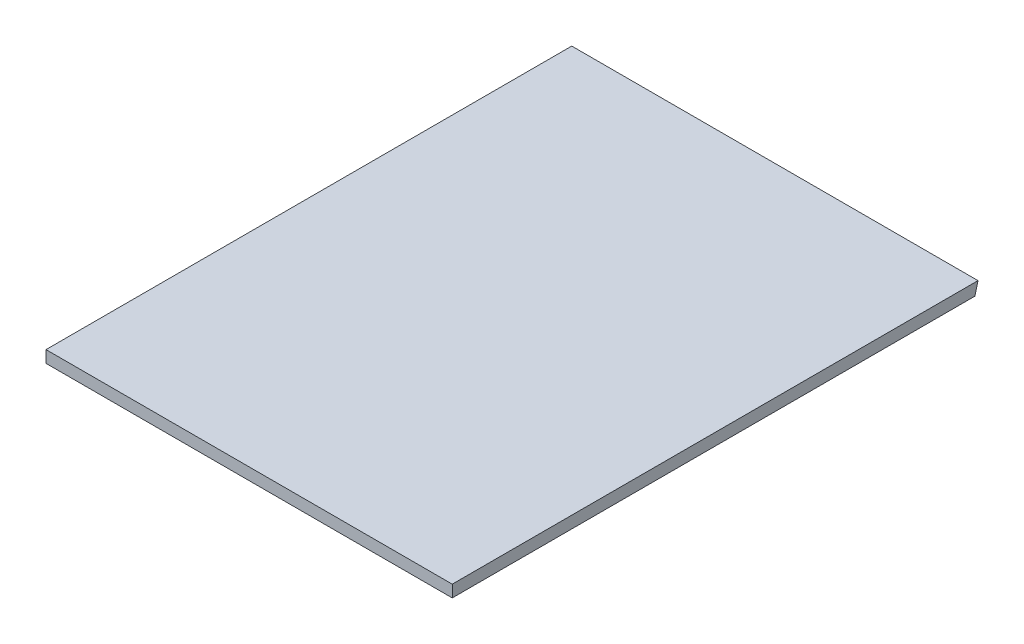
ISO-10303-21;
HEADER;
FILE_DESCRIPTION(('STEP AP214'),'2;1');
FILE_NAME('part.step','',(''),(''),'','','');
FILE_SCHEMA(('AUTOMOTIVE_DESIGN { 1 0 10303 214 1 1 1 1 }'));
ENDSEC;
DATA;
#1=APPLICATION_CONTEXT('core data for automotive mechanical design processes');
#2=APPLICATION_PROTOCOL_DEFINITION('international standard','automotive_design',2000,#1);
#3=PRODUCT_CONTEXT('',#1,'mechanical');
#4=PRODUCT('Part','Part','',(#3));
#5=PRODUCT_RELATED_PRODUCT_CATEGORY('part','',(#4));
#6=PRODUCT_DEFINITION_FORMATION('','',#4);
#7=PRODUCT_DEFINITION_CONTEXT('part definition',#1,'design');
#8=PRODUCT_DEFINITION('design','',#6,#7);
#9=PRODUCT_DEFINITION_SHAPE('','',#8);
#10=(LENGTH_UNIT() NAMED_UNIT(*) SI_UNIT(.MILLI.,.METRE.));
#11=(NAMED_UNIT(*) PLANE_ANGLE_UNIT() SI_UNIT($,.RADIAN.));
#12=(NAMED_UNIT(*) SI_UNIT($,.STERADIAN.) SOLID_ANGLE_UNIT());
#13=UNCERTAINTY_MEASURE_WITH_UNIT(LENGTH_MEASURE(1.E-05),#10,'distance_accuracy_value','');
#14=(GEOMETRIC_REPRESENTATION_CONTEXT(3) GLOBAL_UNCERTAINTY_ASSIGNED_CONTEXT((#13)) GLOBAL_UNIT_ASSIGNED_CONTEXT((#10,
#11,#12)) REPRESENTATION_CONTEXT('',''));
#15=CARTESIAN_POINT('',(0.,0.,0.));
#16=DIRECTION('',(0.,0.,1.));
#17=DIRECTION('',(1.,0.,0.));
#18=AXIS2_PLACEMENT_3D('',#15,#16,#17);
#19=CARTESIAN_POINT('',(-170.,5.,-11.0314285714286));
#20=DIRECTION('',(1.,0.,0.));
#21=DIRECTION('',(0.,0.,-1.));
#22=AXIS2_PLACEMENT_3D('',#19,#20,#21);
#23=PLANE('',#22);
#24=DIRECTION('',(0.,0.967074537246969,-0.254493299339217));
#25=VECTOR('',#24,1.);
#26=CARTESIAN_POINT('',(-170.,5.00000000000001,-11.0314285714286));
#27=LINE('',#26,#25);
#28=CARTESIAN_POINT('',(-170.,0.,-9.715639097415));
#29=VERTEX_POINT('',#28);
#30=CARTESIAN_POINT('',(-170.,5.,-11.0314285714286));
#31=VERTEX_POINT('',#30);
#32=EDGE_CURVE('E82',#29,#31,#27,.T.);
#33=ORIENTED_EDGE('',*,*,#32,.F.);
#34=DIRECTION('',(0.,0.,1.));
#35=VECTOR('',#34,1.);
#36=CARTESIAN_POINT('',(-170.,0.,-11.0314285714286));
#37=LINE('',#36,#35);
#38=CARTESIAN_POINT('',(-170.,0.,208.968571428571));
#39=VERTEX_POINT('',#38);
#40=EDGE_CURVE('E77',#29,#39,#37,.T.);
#41=ORIENTED_EDGE('',*,*,#40,.T.);
#42=DIRECTION('',(0.,-1.,0.));
#43=VECTOR('',#42,1.);
#44=CARTESIAN_POINT('',(-170.,5.,208.968571428571));
#45=LINE('',#44,#43);
#46=CARTESIAN_POINT('',(-170.,5.,208.968571428571));
#47=VERTEX_POINT('',#46);
#48=EDGE_CURVE('E39',#47,#39,#45,.T.);
#49=ORIENTED_EDGE('',*,*,#48,.F.);
#50=DIRECTION('',(0.,0.,1.));
#51=VECTOR('',#50,1.);
#52=CARTESIAN_POINT('',(-170.,5.,-11.0314285714286));
#53=LINE('',#52,#51);
#54=EDGE_CURVE('E85',#31,#47,#53,.T.);
#55=ORIENTED_EDGE('',*,*,#54,.F.);
#56=EDGE_LOOP('',(#33,#41,#49,#55));
#57=FACE_BOUND('',#56,.T.);
#58=ADVANCED_FACE('F32',(#57),#23,.F.);
#59=CARTESIAN_POINT('',(0.,5.,-11.0314285714286));
#60=DIRECTION('',(-1.,0.,0.));
#61=DIRECTION('',(0.,0.,1.));
#62=AXIS2_PLACEMENT_3D('',#59,#60,#61);
#63=PLANE('',#62);
#64=DIRECTION('',(0.,-0.967074537246969,0.254493299339217));
#65=VECTOR('',#64,1.);
#66=CARTESIAN_POINT('',(0.,5.,-11.0314285714286));
#67=LINE('',#66,#65);
#68=CARTESIAN_POINT('',(0.,5.,-11.0314285714286));
#69=VERTEX_POINT('',#68);
#70=CARTESIAN_POINT('',(0.,0.,-9.71563909741501));
#71=VERTEX_POINT('',#70);
#72=EDGE_CURVE('E87',#69,#71,#67,.T.);
#73=ORIENTED_EDGE('',*,*,#72,.F.);
#74=DIRECTION('',(0.,0.,-1.));
#75=VECTOR('',#74,1.);
#76=CARTESIAN_POINT('',(0.,5.,-11.0314285714286));
#77=LINE('',#76,#75);
#78=CARTESIAN_POINT('',(0.,5.,208.968571428571));
#79=VERTEX_POINT('',#78);
#80=EDGE_CURVE('E98',#79,#69,#77,.T.);
#81=ORIENTED_EDGE('',*,*,#80,.F.);
#82=DIRECTION('',(0.,-1.,0.));
#83=VECTOR('',#82,1.);
#84=CARTESIAN_POINT('',(0.,5.,208.968571428571));
#85=LINE('',#84,#83);
#86=CARTESIAN_POINT('',(0.,0.,208.968571428571));
#87=VERTEX_POINT('',#86);
#88=EDGE_CURVE('E100',#79,#87,#85,.T.);
#89=ORIENTED_EDGE('',*,*,#88,.T.);
#90=DIRECTION('',(0.,0.,-1.));
#91=VECTOR('',#90,1.);
#92=CARTESIAN_POINT('',(0.,0.,-11.0314285714286));
#93=LINE('',#92,#91);
#94=EDGE_CURVE('E96',#87,#71,#93,.T.);
#95=ORIENTED_EDGE('',*,*,#94,.T.);
#96=EDGE_LOOP('',(#73,#81,#89,#95));
#97=FACE_BOUND('',#96,.T.);
#98=ADVANCED_FACE('F112',(#97),#63,.F.);
#99=CARTESIAN_POINT('',(0.,0.,0.));
#100=DIRECTION('',(0.,1.,0.));
#101=DIRECTION('',(0.,0.,1.));
#102=AXIS2_PLACEMENT_3D('',#99,#100,#101);
#103=PLANE('',#102);
#104=DIRECTION('',(-1.,0.,0.));
#105=VECTOR('',#104,1.);
#106=CARTESIAN_POINT('',(0.,0.,-9.71563909741502));
#107=LINE('',#106,#105);
#108=EDGE_CURVE('E11',#71,#29,#107,.T.);
#109=ORIENTED_EDGE('',*,*,#108,.F.);
#110=ORIENTED_EDGE('',*,*,#94,.F.);
#111=DIRECTION('',(1.,0.,0.));
#112=VECTOR('',#111,1.);
#113=CARTESIAN_POINT('',(-170.,0.,208.968571428571));
#114=LINE('',#113,#112);
#115=EDGE_CURVE('E70',#39,#87,#114,.T.);
#116=ORIENTED_EDGE('',*,*,#115,.F.);
#117=ORIENTED_EDGE('',*,*,#40,.F.);
#118=EDGE_LOOP('',(#109,#110,#116,#117));
#119=FACE_BOUND('',#118,.T.);
#120=ADVANCED_FACE('F79',(#119),#103,.F.);
#121=CARTESIAN_POINT('',(-170.,5.,208.968571428571));
#122=DIRECTION('',(0.,0.,-1.));
#123=DIRECTION('',(-1.,0.,0.));
#124=AXIS2_PLACEMENT_3D('',#121,#122,#123);
#125=PLANE('',#124);
#126=ORIENTED_EDGE('',*,*,#115,.T.);
#127=ORIENTED_EDGE('',*,*,#88,.F.);
#128=DIRECTION('',(1.,0.,0.));
#129=VECTOR('',#128,1.);
#130=CARTESIAN_POINT('',(-170.,5.,208.968571428571));
#131=LINE('',#130,#129);
#132=EDGE_CURVE('E75',#47,#79,#131,.T.);
#133=ORIENTED_EDGE('',*,*,#132,.F.);
#134=ORIENTED_EDGE('',*,*,#48,.T.);
#135=EDGE_LOOP('',(#126,#127,#133,#134));
#136=FACE_BOUND('',#135,.T.);
#137=ADVANCED_FACE('F104',(#136),#125,.F.);
#138=CARTESIAN_POINT('',(0.,5.,0.));
#139=DIRECTION('',(0.,1.,0.));
#140=DIRECTION('',(0.,0.,1.));
#141=AXIS2_PLACEMENT_3D('',#138,#139,#140);
#142=PLANE('',#141);
#143=ORIENTED_EDGE('',*,*,#54,.T.);
#144=ORIENTED_EDGE('',*,*,#132,.T.);
#145=ORIENTED_EDGE('',*,*,#80,.T.);
#146=DIRECTION('',(-1.,0.,0.));
#147=VECTOR('',#146,1.);
#148=CARTESIAN_POINT('',(-170.,5.,-11.0314285714286));
#149=LINE('',#148,#147);
#150=EDGE_CURVE('E53',#69,#31,#149,.T.);
#151=ORIENTED_EDGE('',*,*,#150,.T.);
#152=EDGE_LOOP('',(#143,#144,#145,#151));
#153=FACE_BOUND('',#152,.T.);
#154=ADVANCED_FACE('F106',(#153),#142,.T.);
#155=CARTESIAN_POINT('',(560.092164037108,5.,-11.0314285714286));
#156=DIRECTION('',(0.,-0.254493299339217,-0.967074537246969));
#157=DIRECTION('',(0.,0.967074537246969,-0.254493299339217));
#158=AXIS2_PLACEMENT_3D('',#155,#156,#157);
#159=PLANE('',#158);
#160=ORIENTED_EDGE('',*,*,#108,.T.);
#161=ORIENTED_EDGE('',*,*,#32,.T.);
#162=ORIENTED_EDGE('',*,*,#150,.F.);
#163=ORIENTED_EDGE('',*,*,#72,.T.);
#164=EDGE_LOOP('',(#160,#161,#162,#163));
#165=FACE_BOUND('',#164,.T.);
#166=ADVANCED_FACE('F90',(#165),#159,.T.);
#167=CLOSED_SHELL('',(#58,#98,#120,#137,#154,#166));
#168=MANIFOLD_SOLID_BREP('B2',#167);
#169=ADVANCED_BREP_SHAPE_REPRESENTATION('',(#18,#168),#14);
#170=SHAPE_DEFINITION_REPRESENTATION(#9,#169);
ENDSEC;
END-ISO-10303-21;
